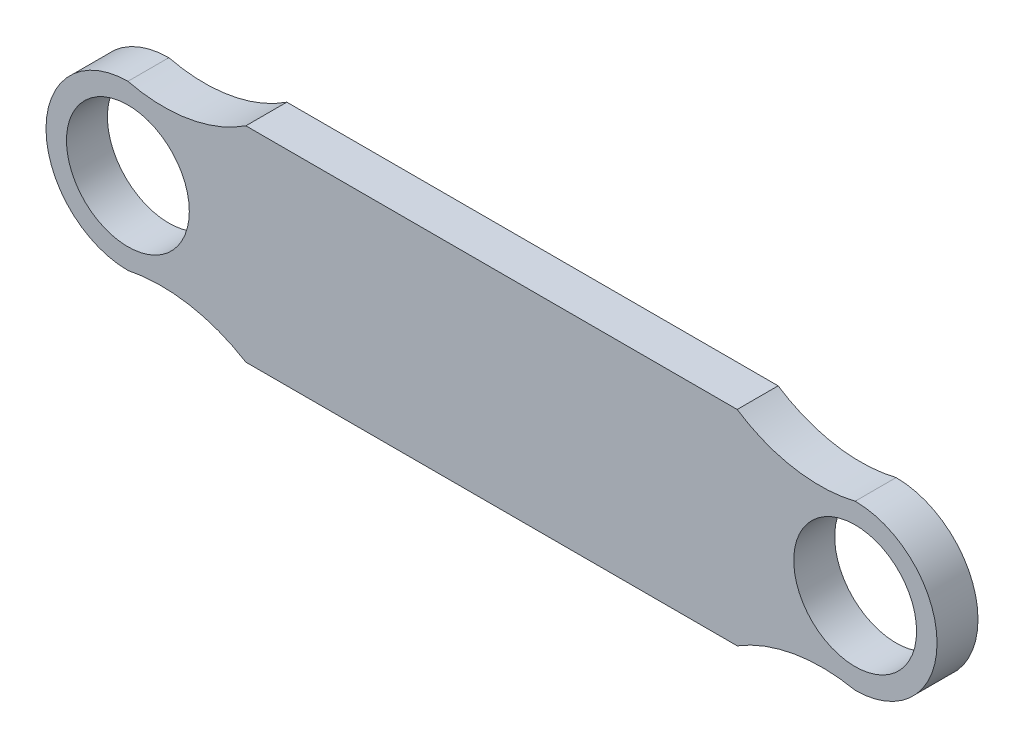
ISO-10303-21;
HEADER;
FILE_DESCRIPTION(('STEP AP214'),'2;1');
FILE_NAME('part.step','',(''),(''),'','','');
FILE_SCHEMA(('AUTOMOTIVE_DESIGN { 1 0 10303 214 1 1 1 1 }'));
ENDSEC;
DATA;
#1=APPLICATION_CONTEXT('core data for automotive mechanical design processes');
#2=APPLICATION_PROTOCOL_DEFINITION('international standard','automotive_design',2000,#1);
#3=PRODUCT_CONTEXT('',#1,'mechanical');
#4=PRODUCT('Part','Part','',(#3));
#5=PRODUCT_RELATED_PRODUCT_CATEGORY('part','',(#4));
#6=PRODUCT_DEFINITION_FORMATION('','',#4);
#7=PRODUCT_DEFINITION_CONTEXT('part definition',#1,'design');
#8=PRODUCT_DEFINITION('design','',#6,#7);
#9=PRODUCT_DEFINITION_SHAPE('','',#8);
#10=(LENGTH_UNIT() NAMED_UNIT(*) SI_UNIT(.MILLI.,.METRE.));
#11=(NAMED_UNIT(*) PLANE_ANGLE_UNIT() SI_UNIT($,.RADIAN.));
#12=(NAMED_UNIT(*) SI_UNIT($,.STERADIAN.) SOLID_ANGLE_UNIT());
#13=UNCERTAINTY_MEASURE_WITH_UNIT(LENGTH_MEASURE(1.E-05),#10,'distance_accuracy_value','');
#14=(GEOMETRIC_REPRESENTATION_CONTEXT(3) GLOBAL_UNCERTAINTY_ASSIGNED_CONTEXT((#13)) GLOBAL_UNIT_ASSIGNED_CONTEXT((#10,
#11,#12)) REPRESENTATION_CONTEXT('',''));
#15=CARTESIAN_POINT('',(0.,0.,0.));
#16=DIRECTION('',(0.,0.,1.));
#17=DIRECTION('',(1.,0.,0.));
#18=AXIS2_PLACEMENT_3D('',#15,#16,#17);
#19=CARTESIAN_POINT('',(-26.6440677966102,0.,3.));
#20=DIRECTION('',(0.,0.,-1.));
#21=DIRECTION('',(-1.,0.,0.));
#22=AXIS2_PLACEMENT_3D('',#19,#20,#21);
#23=CYLINDRICAL_SURFACE('',#22,6.);
#24=CARTESIAN_POINT('',(-26.6440677966102,0.,0.));
#25=DIRECTION('',(0.,0.,1.));
#26=DIRECTION('',(1.,0.,0.));
#27=AXIS2_PLACEMENT_3D('',#24,#25,#26);
#28=CIRCLE('',#27,6.);
#29=CARTESIAN_POINT('',(-26.6440677966102,-6.,0.));
#30=VERTEX_POINT('',#29);
#31=CARTESIAN_POINT('',(-26.6440677966102,6.,0.));
#32=VERTEX_POINT('',#31);
#33=EDGE_CURVE('E150',#30,#32,#28,.F.);
#34=ORIENTED_EDGE('',*,*,#33,.F.);
#35=DIRECTION('',(0.,0.,-1.));
#36=VECTOR('',#35,1.);
#37=CARTESIAN_POINT('',(-26.6440677966102,-6.,3.));
#38=LINE('',#37,#36);
#39=CARTESIAN_POINT('',(-26.6440677966102,-6.,3.));
#40=VERTEX_POINT('',#39);
#41=EDGE_CURVE('E11',#40,#30,#38,.T.);
#42=ORIENTED_EDGE('',*,*,#41,.F.);
#43=CARTESIAN_POINT('',(-26.6440677966102,0.,3.));
#44=DIRECTION('',(0.,0.,1.));
#45=DIRECTION('',(1.,0.,0.));
#46=AXIS2_PLACEMENT_3D('',#43,#44,#45);
#47=CIRCLE('',#46,6.);
#48=CARTESIAN_POINT('',(-26.6440677966102,6.,3.));
#49=VERTEX_POINT('',#48);
#50=EDGE_CURVE('E214',#40,#49,#47,.F.);
#51=ORIENTED_EDGE('',*,*,#50,.T.);
#52=DIRECTION('',(0.,0.,-1.));
#53=VECTOR('',#52,1.);
#54=CARTESIAN_POINT('',(-26.6440677966102,6.,3.));
#55=LINE('',#54,#53);
#56=EDGE_CURVE('E95',#49,#32,#55,.T.);
#57=ORIENTED_EDGE('',*,*,#56,.T.);
#58=EDGE_LOOP('',(#34,#42,#51,#57));
#59=FACE_BOUND('',#58,.T.);
#60=ADVANCED_FACE('F43',(#59),#23,.T.);
#61=CARTESIAN_POINT('',(-24.2182119558591,-17.6771277892941,3.));
#62=DIRECTION('',(0.,0.,-1.));
#63=DIRECTION('',(-1.,0.,0.));
#64=AXIS2_PLACEMENT_3D('',#61,#62,#63);
#65=CYLINDRICAL_SURFACE('',#64,11.9264449844709);
#66=CARTESIAN_POINT('',(-24.2182119558591,-17.6771277892941,0.));
#67=DIRECTION('',(0.,0.,1.));
#68=DIRECTION('',(1.,0.,0.));
#69=AXIS2_PLACEMENT_3D('',#66,#67,#68);
#70=CIRCLE('',#69,11.9264449844709);
#71=CARTESIAN_POINT('',(-18.,-7.5,0.));
#72=VERTEX_POINT('',#71);
#73=EDGE_CURVE('E154',#72,#30,#70,.T.);
#74=ORIENTED_EDGE('',*,*,#73,.F.);
#75=DIRECTION('',(0.,0.,-1.));
#76=VECTOR('',#75,1.);
#77=CARTESIAN_POINT('',(-18.,-7.5,3.));
#78=LINE('',#77,#76);
#79=CARTESIAN_POINT('',(-18.,-7.5,3.));
#80=VERTEX_POINT('',#79);
#81=EDGE_CURVE('E53',#80,#72,#78,.T.);
#82=ORIENTED_EDGE('',*,*,#81,.F.);
#83=CARTESIAN_POINT('',(-24.2182119558591,-17.6771277892941,3.));
#84=DIRECTION('',(0.,0.,1.));
#85=DIRECTION('',(1.,0.,0.));
#86=AXIS2_PLACEMENT_3D('',#83,#84,#85);
#87=CIRCLE('',#86,11.9264449844709);
#88=EDGE_CURVE('E212',#80,#40,#87,.T.);
#89=ORIENTED_EDGE('',*,*,#88,.T.);
#90=ORIENTED_EDGE('',*,*,#41,.T.);
#91=EDGE_LOOP('',(#74,#82,#89,#90));
#92=FACE_BOUND('',#91,.T.);
#93=ADVANCED_FACE('F211',(#92),#65,.F.);
#94=CARTESIAN_POINT('',(0.,-7.5,3.));
#95=DIRECTION('',(0.,1.,0.));
#96=DIRECTION('',(0.,0.,1.));
#97=AXIS2_PLACEMENT_3D('',#94,#95,#96);
#98=PLANE('',#97);
#99=DIRECTION('',(1.,0.,0.));
#100=VECTOR('',#99,1.);
#101=CARTESIAN_POINT('',(0.,-7.5,0.));
#102=LINE('',#101,#100);
#103=CARTESIAN_POINT('',(18.,-7.5,0.));
#104=VERTEX_POINT('',#103);
#105=EDGE_CURVE('E158',#72,#104,#102,.T.);
#106=ORIENTED_EDGE('',*,*,#105,.T.);
#107=DIRECTION('',(0.,0.,-1.));
#108=VECTOR('',#107,1.);
#109=CARTESIAN_POINT('',(18.,-7.5,3.));
#110=LINE('',#109,#108);
#111=CARTESIAN_POINT('',(18.,-7.5,3.));
#112=VERTEX_POINT('',#111);
#113=EDGE_CURVE('E193',#112,#104,#110,.T.);
#114=ORIENTED_EDGE('',*,*,#113,.F.);
#115=DIRECTION('',(1.,0.,0.));
#116=VECTOR('',#115,1.);
#117=CARTESIAN_POINT('',(0.,-7.5,3.));
#118=LINE('',#117,#116);
#119=EDGE_CURVE('E203',#80,#112,#118,.T.);
#120=ORIENTED_EDGE('',*,*,#119,.F.);
#121=ORIENTED_EDGE('',*,*,#81,.T.);
#122=EDGE_LOOP('',(#106,#114,#120,#121));
#123=FACE_BOUND('',#122,.T.);
#124=ADVANCED_FACE('F200',(#123),#98,.F.);
#125=CARTESIAN_POINT('',(24.2182119558591,-17.6771277892941,3.));
#126=DIRECTION('',(0.,0.,-1.));
#127=DIRECTION('',(-1.,0.,0.));
#128=AXIS2_PLACEMENT_3D('',#125,#126,#127);
#129=CYLINDRICAL_SURFACE('',#128,11.9264449844709);
#130=CARTESIAN_POINT('',(24.2182119558591,-17.6771277892941,0.));
#131=DIRECTION('',(0.,0.,1.));
#132=DIRECTION('',(1.,0.,0.));
#133=AXIS2_PLACEMENT_3D('',#130,#131,#132);
#134=CIRCLE('',#133,11.9264449844709);
#135=CARTESIAN_POINT('',(26.6440677966102,-6.,0.));
#136=VERTEX_POINT('',#135);
#137=EDGE_CURVE('E162',#104,#136,#134,.F.);
#138=ORIENTED_EDGE('',*,*,#137,.T.);
#139=DIRECTION('',(0.,0.,-1.));
#140=VECTOR('',#139,1.);
#141=CARTESIAN_POINT('',(26.6440677966102,-6.,3.));
#142=LINE('',#141,#140);
#143=CARTESIAN_POINT('',(26.6440677966102,-6.,3.));
#144=VERTEX_POINT('',#143);
#145=EDGE_CURVE('E189',#144,#136,#142,.T.);
#146=ORIENTED_EDGE('',*,*,#145,.F.);
#147=CARTESIAN_POINT('',(24.2182119558591,-17.6771277892941,3.));
#148=DIRECTION('',(0.,0.,1.));
#149=DIRECTION('',(1.,0.,0.));
#150=AXIS2_PLACEMENT_3D('',#147,#148,#149);
#151=CIRCLE('',#150,11.9264449844709);
#152=EDGE_CURVE('E225',#112,#144,#151,.F.);
#153=ORIENTED_EDGE('',*,*,#152,.F.);
#154=ORIENTED_EDGE('',*,*,#113,.T.);
#155=EDGE_LOOP('',(#138,#146,#153,#154));
#156=FACE_BOUND('',#155,.T.);
#157=ADVANCED_FACE('F230',(#156),#129,.F.);
#158=CARTESIAN_POINT('',(26.6440677966102,0.,3.));
#159=DIRECTION('',(0.,0.,-1.));
#160=DIRECTION('',(-1.,0.,0.));
#161=AXIS2_PLACEMENT_3D('',#158,#159,#160);
#162=CYLINDRICAL_SURFACE('',#161,6.);
#163=CARTESIAN_POINT('',(26.6440677966102,0.,0.));
#164=DIRECTION('',(0.,0.,1.));
#165=DIRECTION('',(1.,0.,0.));
#166=AXIS2_PLACEMENT_3D('',#163,#164,#165);
#167=CIRCLE('',#166,6.);
#168=CARTESIAN_POINT('',(26.6440677966102,6.,0.));
#169=VERTEX_POINT('',#168);
#170=EDGE_CURVE('E166',#136,#169,#167,.T.);
#171=ORIENTED_EDGE('',*,*,#170,.T.);
#172=DIRECTION('',(0.,0.,-1.));
#173=VECTOR('',#172,1.);
#174=CARTESIAN_POINT('',(26.6440677966102,6.,3.));
#175=LINE('',#174,#173);
#176=CARTESIAN_POINT('',(26.6440677966102,6.,3.));
#177=VERTEX_POINT('',#176);
#178=EDGE_CURVE('E125',#177,#169,#175,.T.);
#179=ORIENTED_EDGE('',*,*,#178,.F.);
#180=CARTESIAN_POINT('',(26.6440677966102,0.,3.));
#181=DIRECTION('',(0.,0.,1.));
#182=DIRECTION('',(1.,0.,0.));
#183=AXIS2_PLACEMENT_3D('',#180,#181,#182);
#184=CIRCLE('',#183,6.);
#185=EDGE_CURVE('E131',#144,#177,#184,.T.);
#186=ORIENTED_EDGE('',*,*,#185,.F.);
#187=ORIENTED_EDGE('',*,*,#145,.T.);
#188=EDGE_LOOP('',(#171,#179,#186,#187));
#189=FACE_BOUND('',#188,.T.);
#190=ADVANCED_FACE('F232',(#189),#162,.T.);
#191=CARTESIAN_POINT('',(24.040924754712,16.6554727318367,3.));
#192=DIRECTION('',(0.,0.,-1.));
#193=DIRECTION('',(-1.,0.,0.));
#194=AXIS2_PLACEMENT_3D('',#191,#192,#193);
#195=CYLINDRICAL_SURFACE('',#194,10.9688400861485);
#196=CARTESIAN_POINT('',(24.040924754712,16.6554727318367,0.));
#197=DIRECTION('',(0.,0.,1.));
#198=DIRECTION('',(1.,0.,0.));
#199=AXIS2_PLACEMENT_3D('',#196,#197,#198);
#200=CIRCLE('',#199,10.9688400861485);
#201=CARTESIAN_POINT('',(18.,7.5,0.));
#202=VERTEX_POINT('',#201);
#203=EDGE_CURVE('E119',#202,#169,#200,.T.);
#204=ORIENTED_EDGE('',*,*,#203,.F.);
#205=DIRECTION('',(0.,0.,-1.));
#206=VECTOR('',#205,1.);
#207=CARTESIAN_POINT('',(18.,7.5,3.));
#208=LINE('',#207,#206);
#209=CARTESIAN_POINT('',(18.,7.5,3.));
#210=VERTEX_POINT('',#209);
#211=EDGE_CURVE('E114',#210,#202,#208,.T.);
#212=ORIENTED_EDGE('',*,*,#211,.F.);
#213=CARTESIAN_POINT('',(24.040924754712,16.6554727318367,3.));
#214=DIRECTION('',(0.,0.,1.));
#215=DIRECTION('',(1.,0.,0.));
#216=AXIS2_PLACEMENT_3D('',#213,#214,#215);
#217=CIRCLE('',#216,10.9688400861485);
#218=EDGE_CURVE('E117',#210,#177,#217,.T.);
#219=ORIENTED_EDGE('',*,*,#218,.T.);
#220=ORIENTED_EDGE('',*,*,#178,.T.);
#221=EDGE_LOOP('',(#204,#212,#219,#220));
#222=FACE_BOUND('',#221,.T.);
#223=ADVANCED_FACE('F116',(#222),#195,.F.);
#224=CARTESIAN_POINT('',(0.,7.5,3.));
#225=DIRECTION('',(0.,1.,0.));
#226=DIRECTION('',(0.,0.,1.));
#227=AXIS2_PLACEMENT_3D('',#224,#225,#226);
#228=PLANE('',#227);
#229=DIRECTION('',(1.,0.,0.));
#230=VECTOR('',#229,1.);
#231=CARTESIAN_POINT('',(0.,7.5,0.));
#232=LINE('',#231,#230);
#233=CARTESIAN_POINT('',(-18.,7.5,0.));
#234=VERTEX_POINT('',#233);
#235=EDGE_CURVE('E172',#234,#202,#232,.T.);
#236=ORIENTED_EDGE('',*,*,#235,.F.);
#237=DIRECTION('',(0.,0.,-1.));
#238=VECTOR('',#237,1.);
#239=CARTESIAN_POINT('',(-18.,7.5,3.));
#240=LINE('',#239,#238);
#241=CARTESIAN_POINT('',(-18.,7.5,3.));
#242=VERTEX_POINT('',#241);
#243=EDGE_CURVE('E88',#242,#234,#240,.T.);
#244=ORIENTED_EDGE('',*,*,#243,.F.);
#245=DIRECTION('',(1.,0.,0.));
#246=VECTOR('',#245,1.);
#247=CARTESIAN_POINT('',(0.,7.5,3.));
#248=LINE('',#247,#246);
#249=EDGE_CURVE('E129',#242,#210,#248,.T.);
#250=ORIENTED_EDGE('',*,*,#249,.T.);
#251=ORIENTED_EDGE('',*,*,#211,.T.);
#252=EDGE_LOOP('',(#236,#244,#250,#251));
#253=FACE_BOUND('',#252,.T.);
#254=ADVANCED_FACE('F135',(#253),#228,.T.);
#255=CARTESIAN_POINT('',(-24.040924754712,16.6554727318367,3.));
#256=DIRECTION('',(0.,0.,-1.));
#257=DIRECTION('',(-1.,0.,0.));
#258=AXIS2_PLACEMENT_3D('',#255,#256,#257);
#259=CYLINDRICAL_SURFACE('',#258,10.9688400861485);
#260=CARTESIAN_POINT('',(-24.040924754712,16.6554727318367,0.));
#261=DIRECTION('',(0.,0.,1.));
#262=DIRECTION('',(1.,0.,0.));
#263=AXIS2_PLACEMENT_3D('',#260,#261,#262);
#264=CIRCLE('',#263,10.9688400861485);
#265=EDGE_CURVE('E175',#234,#32,#264,.F.);
#266=ORIENTED_EDGE('',*,*,#265,.T.);
#267=ORIENTED_EDGE('',*,*,#56,.F.);
#268=CARTESIAN_POINT('',(-24.040924754712,16.6554727318367,3.));
#269=DIRECTION('',(0.,0.,1.));
#270=DIRECTION('',(1.,0.,0.));
#271=AXIS2_PLACEMENT_3D('',#268,#269,#270);
#272=CIRCLE('',#271,10.9688400861485);
#273=EDGE_CURVE('E61',#242,#49,#272,.F.);
#274=ORIENTED_EDGE('',*,*,#273,.F.);
#275=ORIENTED_EDGE('',*,*,#243,.T.);
#276=EDGE_LOOP('',(#266,#267,#274,#275));
#277=FACE_BOUND('',#276,.T.);
#278=ADVANCED_FACE('F213',(#277),#259,.F.);
#279=CARTESIAN_POINT('',(26.6440677966102,0.,3.));
#280=DIRECTION('',(0.,0.,-1.));
#281=DIRECTION('',(-1.,0.,0.));
#282=AXIS2_PLACEMENT_3D('',#279,#280,#281);
#283=CYLINDRICAL_SURFACE('',#282,4.5);
#284=CARTESIAN_POINT('',(26.6440677966102,0.,3.));
#285=DIRECTION('',(0.,0.,1.));
#286=DIRECTION('',(1.,0.,0.));
#287=AXIS2_PLACEMENT_3D('',#284,#285,#286);
#288=CIRCLE('',#287,4.5);
#289=CARTESIAN_POINT('',(31.1440677966102,0.,3.));
#290=VERTEX_POINT('',#289);
#291=EDGE_CURVE('E182',#290,#290,#288,.T.);
#292=ORIENTED_EDGE('',*,*,#291,.T.);
#293=EDGE_LOOP('',(#292));
#294=FACE_BOUND('',#293,.T.);
#295=CARTESIAN_POINT('',(26.6440677966102,0.,0.));
#296=DIRECTION('',(0.,0.,1.));
#297=DIRECTION('',(1.,0.,0.));
#298=AXIS2_PLACEMENT_3D('',#295,#296,#297);
#299=CIRCLE('',#298,4.5);
#300=CARTESIAN_POINT('',(31.1440677966102,0.,0.));
#301=VERTEX_POINT('',#300);
#302=EDGE_CURVE('E146',#301,#301,#299,.T.);
#303=ORIENTED_EDGE('',*,*,#302,.F.);
#304=EDGE_LOOP('',(#303));
#305=FACE_BOUND('',#304,.T.);
#306=ADVANCED_FACE('F45',(#294,#305),#283,.F.);
#307=CARTESIAN_POINT('',(-26.6440677966102,0.,3.));
#308=DIRECTION('',(0.,0.,-1.));
#309=DIRECTION('',(-1.,0.,0.));
#310=AXIS2_PLACEMENT_3D('',#307,#308,#309);
#311=CYLINDRICAL_SURFACE('',#310,4.5);
#312=CARTESIAN_POINT('',(-26.6440677966102,0.,3.));
#313=DIRECTION('',(0.,0.,1.));
#314=DIRECTION('',(1.,0.,0.));
#315=AXIS2_PLACEMENT_3D('',#312,#313,#314);
#316=CIRCLE('',#315,4.5);
#317=CARTESIAN_POINT('',(-22.1440677966102,0.,3.));
#318=VERTEX_POINT('',#317);
#319=EDGE_CURVE('E139',#318,#318,#316,.F.);
#320=ORIENTED_EDGE('',*,*,#319,.F.);
#321=EDGE_LOOP('',(#320));
#322=FACE_BOUND('',#321,.T.);
#323=CARTESIAN_POINT('',(-26.6440677966102,0.,0.));
#324=DIRECTION('',(0.,0.,1.));
#325=DIRECTION('',(1.,0.,0.));
#326=AXIS2_PLACEMENT_3D('',#323,#324,#325);
#327=CIRCLE('',#326,4.5);
#328=CARTESIAN_POINT('',(-22.1440677966102,0.,0.));
#329=VERTEX_POINT('',#328);
#330=EDGE_CURVE('E178',#329,#329,#327,.F.);
#331=ORIENTED_EDGE('',*,*,#330,.T.);
#332=EDGE_LOOP('',(#331));
#333=FACE_BOUND('',#332,.T.);
#334=ADVANCED_FACE('F296',(#322,#333),#311,.F.);
#335=CARTESIAN_POINT('',(0.,0.,3.));
#336=DIRECTION('',(0.,0.,1.));
#337=DIRECTION('',(1.,0.,0.));
#338=AXIS2_PLACEMENT_3D('',#335,#336,#337);
#339=PLANE('',#338);
#340=ORIENTED_EDGE('',*,*,#291,.F.);
#341=EDGE_LOOP('',(#340));
#342=FACE_BOUND('',#341,.T.);
#343=ORIENTED_EDGE('',*,*,#50,.F.);
#344=ORIENTED_EDGE('',*,*,#88,.F.);
#345=ORIENTED_EDGE('',*,*,#119,.T.);
#346=ORIENTED_EDGE('',*,*,#152,.T.);
#347=ORIENTED_EDGE('',*,*,#185,.T.);
#348=ORIENTED_EDGE('',*,*,#218,.F.);
#349=ORIENTED_EDGE('',*,*,#249,.F.);
#350=ORIENTED_EDGE('',*,*,#273,.T.);
#351=EDGE_LOOP('',(#343,#344,#345,#346,#347,#348,#349,#350));
#352=FACE_BOUND('',#351,.T.);
#353=ORIENTED_EDGE('',*,*,#319,.T.);
#354=EDGE_LOOP('',(#353));
#355=FACE_BOUND('',#354,.T.);
#356=ADVANCED_FACE('F127',(#342,#352,#355),#339,.T.);
#357=CARTESIAN_POINT('',(0.,0.,0.));
#358=DIRECTION('',(0.,0.,1.));
#359=DIRECTION('',(1.,0.,0.));
#360=AXIS2_PLACEMENT_3D('',#357,#358,#359);
#361=PLANE('',#360);
#362=ORIENTED_EDGE('',*,*,#302,.T.);
#363=EDGE_LOOP('',(#362));
#364=FACE_BOUND('',#363,.T.);
#365=ORIENTED_EDGE('',*,*,#33,.T.);
#366=ORIENTED_EDGE('',*,*,#265,.F.);
#367=ORIENTED_EDGE('',*,*,#235,.T.);
#368=ORIENTED_EDGE('',*,*,#203,.T.);
#369=ORIENTED_EDGE('',*,*,#170,.F.);
#370=ORIENTED_EDGE('',*,*,#137,.F.);
#371=ORIENTED_EDGE('',*,*,#105,.F.);
#372=ORIENTED_EDGE('',*,*,#73,.T.);
#373=EDGE_LOOP('',(#365,#366,#367,#368,#369,#370,#371,#372));
#374=FACE_BOUND('',#373,.T.);
#375=ORIENTED_EDGE('',*,*,#330,.F.);
#376=EDGE_LOOP('',(#375));
#377=FACE_BOUND('',#376,.T.);
#378=ADVANCED_FACE('F209',(#364,#374,#377),#361,.F.);
#379=CLOSED_SHELL('',(#60,#93,#124,#157,#190,#223,#254,#278,#306,#334,#356,#378));
#380=MANIFOLD_SOLID_BREP('B2',#379);
#381=ADVANCED_BREP_SHAPE_REPRESENTATION('',(#18,#380),#14);
#382=SHAPE_DEFINITION_REPRESENTATION(#9,#381);
ENDSEC;
END-ISO-10303-21;
